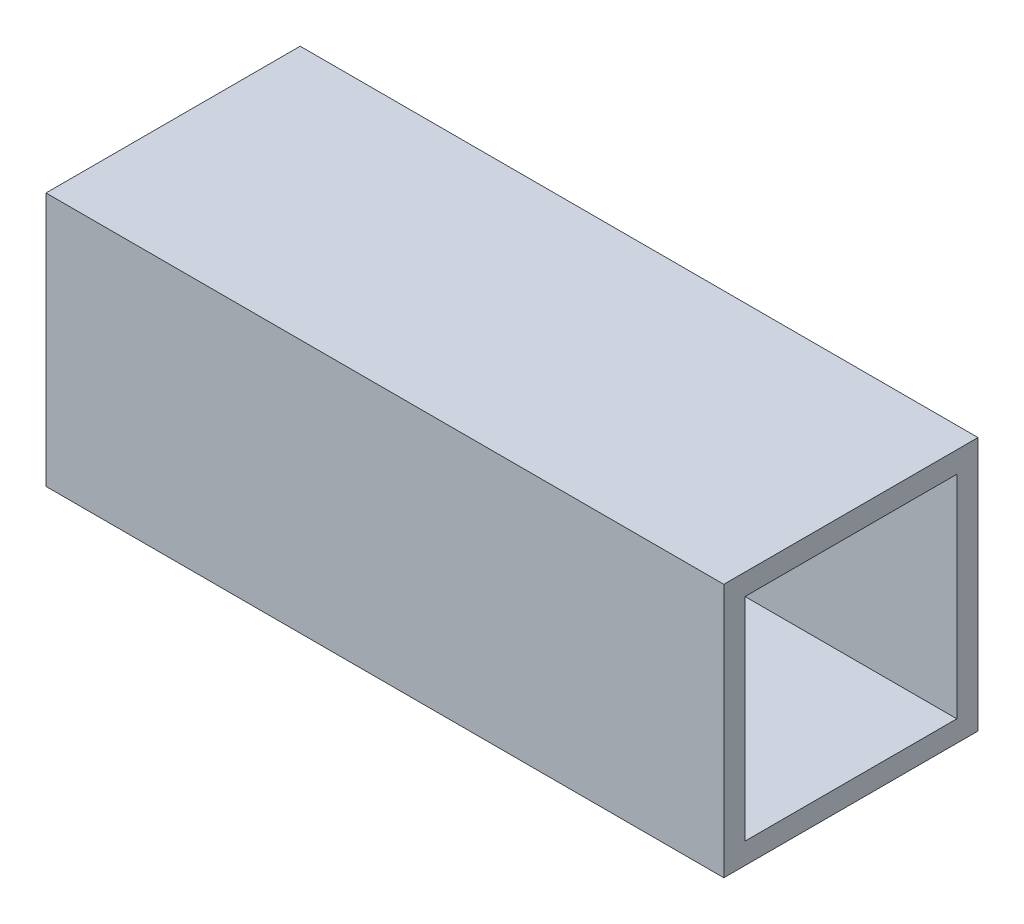
ISO-10303-21;
HEADER;
FILE_DESCRIPTION(('STEP AP214'),'2;1');
FILE_NAME('part.step','',(''),(''),'','','');
FILE_SCHEMA(('AUTOMOTIVE_DESIGN { 1 0 10303 214 1 1 1 1 }'));
ENDSEC;
DATA;
#1=APPLICATION_CONTEXT('core data for automotive mechanical design processes');
#2=APPLICATION_PROTOCOL_DEFINITION('international standard','automotive_design',2000,#1);
#3=PRODUCT_CONTEXT('',#1,'mechanical');
#4=PRODUCT('Part','Part','',(#3));
#5=PRODUCT_RELATED_PRODUCT_CATEGORY('part','',(#4));
#6=PRODUCT_DEFINITION_FORMATION('','',#4);
#7=PRODUCT_DEFINITION_CONTEXT('part definition',#1,'design');
#8=PRODUCT_DEFINITION('design','',#6,#7);
#9=PRODUCT_DEFINITION_SHAPE('','',#8);
#10=(LENGTH_UNIT() NAMED_UNIT(*) SI_UNIT(.MILLI.,.METRE.));
#11=(NAMED_UNIT(*) PLANE_ANGLE_UNIT() SI_UNIT($,.RADIAN.));
#12=(NAMED_UNIT(*) SI_UNIT($,.STERADIAN.) SOLID_ANGLE_UNIT());
#13=UNCERTAINTY_MEASURE_WITH_UNIT(LENGTH_MEASURE(1.E-05),#10,'distance_accuracy_value','');
#14=(GEOMETRIC_REPRESENTATION_CONTEXT(3) GLOBAL_UNCERTAINTY_ASSIGNED_CONTEXT((#13)) GLOBAL_UNIT_ASSIGNED_CONTEXT((#10,
#11,#12)) REPRESENTATION_CONTEXT('',''));
#15=CARTESIAN_POINT('',(0.,0.,0.));
#16=DIRECTION('',(0.,0.,1.));
#17=DIRECTION('',(1.,0.,0.));
#18=AXIS2_PLACEMENT_3D('',#15,#16,#17);
#19=CARTESIAN_POINT('',(-50.8,19.05,-19.05));
#20=DIRECTION('',(0.,1.,0.));
#21=DIRECTION('',(0.,0.,1.));
#22=AXIS2_PLACEMENT_3D('',#19,#20,#21);
#23=PLANE('',#22);
#24=DIRECTION('',(-1.,0.,0.));
#25=VECTOR('',#24,1.);
#26=CARTESIAN_POINT('',(-50.8,19.05,-19.05));
#27=LINE('',#26,#25);
#28=CARTESIAN_POINT('',(-50.8,19.05,-19.05));
#29=VERTEX_POINT('',#28);
#30=CARTESIAN_POINT('',(50.8,19.05,-19.05));
#31=VERTEX_POINT('',#30);
#32=EDGE_CURVE('E114',#29,#31,#27,.F.);
#33=ORIENTED_EDGE('',*,*,#32,.F.);
#34=DIRECTION('',(0.,0.,-1.));
#35=VECTOR('',#34,1.);
#36=CARTESIAN_POINT('',(-50.8,19.05,0.));
#37=LINE('',#36,#35);
#38=CARTESIAN_POINT('',(-50.8,19.05,19.05));
#39=VERTEX_POINT('',#38);
#40=EDGE_CURVE('E136',#29,#39,#37,.F.);
#41=ORIENTED_EDGE('',*,*,#40,.T.);
#42=DIRECTION('',(1.,0.,0.));
#43=VECTOR('',#42,1.);
#44=CARTESIAN_POINT('',(-50.8,19.05,19.05));
#45=LINE('',#44,#43);
#46=CARTESIAN_POINT('',(50.8,19.05,19.05));
#47=VERTEX_POINT('',#46);
#48=EDGE_CURVE('E131',#47,#39,#45,.F.);
#49=ORIENTED_EDGE('',*,*,#48,.F.);
#50=DIRECTION('',(0.,0.,-1.));
#51=VECTOR('',#50,1.);
#52=CARTESIAN_POINT('',(50.8,19.05,0.));
#53=LINE('',#52,#51);
#54=EDGE_CURVE('E106',#31,#47,#53,.F.);
#55=ORIENTED_EDGE('',*,*,#54,.F.);
#56=EDGE_LOOP('',(#33,#41,#49,#55));
#57=FACE_BOUND('',#56,.T.);
#58=ADVANCED_FACE('F17',(#57),#23,.T.);
#59=CARTESIAN_POINT('',(-50.8,15.875,-15.875));
#60=DIRECTION('',(0.,0.,1.));
#61=DIRECTION('',(1.,0.,0.));
#62=AXIS2_PLACEMENT_3D('',#59,#60,#61);
#63=PLANE('',#62);
#64=DIRECTION('',(1.,0.,0.));
#65=VECTOR('',#64,1.);
#66=CARTESIAN_POINT('',(-50.8,15.875,-15.875));
#67=LINE('',#66,#65);
#68=CARTESIAN_POINT('',(-50.8,15.875,-15.875));
#69=VERTEX_POINT('',#68);
#70=CARTESIAN_POINT('',(50.8,15.875,-15.875));
#71=VERTEX_POINT('',#70);
#72=EDGE_CURVE('E91',#69,#71,#67,.T.);
#73=ORIENTED_EDGE('',*,*,#72,.F.);
#74=DIRECTION('',(0.,1.,0.));
#75=VECTOR('',#74,1.);
#76=CARTESIAN_POINT('',(-50.8,0.,-15.875));
#77=LINE('',#76,#75);
#78=CARTESIAN_POINT('',(-50.8,-15.875,-15.875));
#79=VERTEX_POINT('',#78);
#80=EDGE_CURVE('E139',#69,#79,#77,.F.);
#81=ORIENTED_EDGE('',*,*,#80,.T.);
#82=DIRECTION('',(1.,0.,0.));
#83=VECTOR('',#82,1.);
#84=CARTESIAN_POINT('',(-50.8,-15.875,-15.875));
#85=LINE('',#84,#83);
#86=CARTESIAN_POINT('',(50.8,-15.875,-15.875));
#87=VERTEX_POINT('',#86);
#88=EDGE_CURVE('E20',#87,#79,#85,.F.);
#89=ORIENTED_EDGE('',*,*,#88,.F.);
#90=DIRECTION('',(0.,1.,0.));
#91=VECTOR('',#90,1.);
#92=CARTESIAN_POINT('',(50.8,0.,-15.875));
#93=LINE('',#92,#91);
#94=EDGE_CURVE('E105',#71,#87,#93,.F.);
#95=ORIENTED_EDGE('',*,*,#94,.F.);
#96=EDGE_LOOP('',(#73,#81,#89,#95));
#97=FACE_BOUND('',#96,.T.);
#98=ADVANCED_FACE('F125',(#97),#63,.T.);
#99=CARTESIAN_POINT('',(-50.8,-15.875,-15.875));
#100=DIRECTION('',(0.,1.,0.));
#101=DIRECTION('',(0.,0.,1.));
#102=AXIS2_PLACEMENT_3D('',#99,#100,#101);
#103=PLANE('',#102);
#104=ORIENTED_EDGE('',*,*,#88,.T.);
#105=DIRECTION('',(0.,0.,-1.));
#106=VECTOR('',#105,1.);
#107=CARTESIAN_POINT('',(-50.8,-15.875,0.));
#108=LINE('',#107,#106);
#109=CARTESIAN_POINT('',(-50.8,-15.875,15.875));
#110=VERTEX_POINT('',#109);
#111=EDGE_CURVE('E88',#79,#110,#108,.F.);
#112=ORIENTED_EDGE('',*,*,#111,.T.);
#113=DIRECTION('',(-1.,0.,0.));
#114=VECTOR('',#113,1.);
#115=CARTESIAN_POINT('',(-50.8,-15.875,15.875));
#116=LINE('',#115,#114);
#117=CARTESIAN_POINT('',(50.8,-15.875,15.875));
#118=VERTEX_POINT('',#117);
#119=EDGE_CURVE('E80',#118,#110,#116,.T.);
#120=ORIENTED_EDGE('',*,*,#119,.F.);
#121=DIRECTION('',(0.,0.,-1.));
#122=VECTOR('',#121,1.);
#123=CARTESIAN_POINT('',(50.8,-15.875,0.));
#124=LINE('',#123,#122);
#125=EDGE_CURVE('E85',#87,#118,#124,.F.);
#126=ORIENTED_EDGE('',*,*,#125,.F.);
#127=EDGE_LOOP('',(#104,#112,#120,#126));
#128=FACE_BOUND('',#127,.T.);
#129=ADVANCED_FACE('F83',(#128),#103,.T.);
#130=CARTESIAN_POINT('',(-50.8,-15.875,15.875));
#131=DIRECTION('',(0.,0.,-1.));
#132=DIRECTION('',(-1.,0.,0.));
#133=AXIS2_PLACEMENT_3D('',#130,#131,#132);
#134=PLANE('',#133);
#135=ORIENTED_EDGE('',*,*,#119,.T.);
#136=DIRECTION('',(0.,1.,0.));
#137=VECTOR('',#136,1.);
#138=CARTESIAN_POINT('',(-50.8,0.,15.875));
#139=LINE('',#138,#137);
#140=CARTESIAN_POINT('',(-50.8,15.875,15.875));
#141=VERTEX_POINT('',#140);
#142=EDGE_CURVE('E142',#110,#141,#139,.T.);
#143=ORIENTED_EDGE('',*,*,#142,.T.);
#144=DIRECTION('',(1.,0.,0.));
#145=VECTOR('',#144,1.);
#146=CARTESIAN_POINT('',(-50.8,15.875,15.875));
#147=LINE('',#146,#145);
#148=CARTESIAN_POINT('',(50.8,15.875,15.875));
#149=VERTEX_POINT('',#148);
#150=EDGE_CURVE('E96',#149,#141,#147,.F.);
#151=ORIENTED_EDGE('',*,*,#150,.F.);
#152=DIRECTION('',(0.,1.,0.));
#153=VECTOR('',#152,1.);
#154=CARTESIAN_POINT('',(50.8,0.,15.875));
#155=LINE('',#154,#153);
#156=EDGE_CURVE('E93',#118,#149,#155,.T.);
#157=ORIENTED_EDGE('',*,*,#156,.F.);
#158=EDGE_LOOP('',(#135,#143,#151,#157));
#159=FACE_BOUND('',#158,.T.);
#160=ADVANCED_FACE('F94',(#159),#134,.T.);
#161=CARTESIAN_POINT('',(-50.8,15.875,15.875));
#162=DIRECTION('',(0.,-1.,0.));
#163=DIRECTION('',(0.,0.,-1.));
#164=AXIS2_PLACEMENT_3D('',#161,#162,#163);
#165=PLANE('',#164);
#166=ORIENTED_EDGE('',*,*,#150,.T.);
#167=DIRECTION('',(0.,0.,-1.));
#168=VECTOR('',#167,1.);
#169=CARTESIAN_POINT('',(-50.8,15.875,0.));
#170=LINE('',#169,#168);
#171=EDGE_CURVE('E122',#141,#69,#170,.T.);
#172=ORIENTED_EDGE('',*,*,#171,.T.);
#173=ORIENTED_EDGE('',*,*,#72,.T.);
#174=DIRECTION('',(0.,0.,-1.));
#175=VECTOR('',#174,1.);
#176=CARTESIAN_POINT('',(50.8,15.875,0.));
#177=LINE('',#176,#175);
#178=EDGE_CURVE('E100',#149,#71,#177,.T.);
#179=ORIENTED_EDGE('',*,*,#178,.F.);
#180=EDGE_LOOP('',(#166,#172,#173,#179));
#181=FACE_BOUND('',#180,.T.);
#182=ADVANCED_FACE('F120',(#181),#165,.T.);
#183=CARTESIAN_POINT('',(-50.8,-19.05,-19.05));
#184=DIRECTION('',(0.,0.,-1.));
#185=DIRECTION('',(-1.,0.,0.));
#186=AXIS2_PLACEMENT_3D('',#183,#184,#185);
#187=PLANE('',#186);
#188=DIRECTION('',(1.,0.,0.));
#189=VECTOR('',#188,1.);
#190=CARTESIAN_POINT('',(-50.8,-19.05,-19.05));
#191=LINE('',#190,#189);
#192=CARTESIAN_POINT('',(-50.8,-19.05,-19.05));
#193=VERTEX_POINT('',#192);
#194=CARTESIAN_POINT('',(50.8,-19.05,-19.05));
#195=VERTEX_POINT('',#194);
#196=EDGE_CURVE('E145',#193,#195,#191,.T.);
#197=ORIENTED_EDGE('',*,*,#196,.F.);
#198=DIRECTION('',(0.,1.,0.));
#199=VECTOR('',#198,1.);
#200=CARTESIAN_POINT('',(-50.8,0.,-19.05));
#201=LINE('',#200,#199);
#202=EDGE_CURVE('E133',#193,#29,#201,.T.);
#203=ORIENTED_EDGE('',*,*,#202,.T.);
#204=ORIENTED_EDGE('',*,*,#32,.T.);
#205=DIRECTION('',(0.,1.,0.));
#206=VECTOR('',#205,1.);
#207=CARTESIAN_POINT('',(50.8,0.,-19.05));
#208=LINE('',#207,#206);
#209=EDGE_CURVE('E108',#195,#31,#208,.T.);
#210=ORIENTED_EDGE('',*,*,#209,.F.);
#211=EDGE_LOOP('',(#197,#203,#204,#210));
#212=FACE_BOUND('',#211,.T.);
#213=ADVANCED_FACE('F164',(#212),#187,.T.);
#214=CARTESIAN_POINT('',(50.8,0.,0.));
#215=DIRECTION('',(1.,0.,0.));
#216=DIRECTION('',(0.,0.,-1.));
#217=AXIS2_PLACEMENT_3D('',#214,#215,#216);
#218=PLANE('',#217);
#219=ORIENTED_EDGE('',*,*,#178,.T.);
#220=ORIENTED_EDGE('',*,*,#94,.T.);
#221=ORIENTED_EDGE('',*,*,#125,.T.);
#222=ORIENTED_EDGE('',*,*,#156,.T.);
#223=EDGE_LOOP('',(#219,#220,#221,#222));
#224=FACE_BOUND('',#223,.T.);
#225=DIRECTION('',(0.,1.,0.));
#226=VECTOR('',#225,1.);
#227=CARTESIAN_POINT('',(50.8,19.05,19.05));
#228=LINE('',#227,#226);
#229=CARTESIAN_POINT('',(50.8,-19.05,19.05));
#230=VERTEX_POINT('',#229);
#231=EDGE_CURVE('E126',#230,#47,#228,.T.);
#232=ORIENTED_EDGE('',*,*,#231,.F.);
#233=DIRECTION('',(0.,0.,-1.));
#234=VECTOR('',#233,1.);
#235=CARTESIAN_POINT('',(50.8,-19.05,19.05));
#236=LINE('',#235,#234);
#237=EDGE_CURVE('E148',#195,#230,#236,.F.);
#238=ORIENTED_EDGE('',*,*,#237,.F.);
#239=ORIENTED_EDGE('',*,*,#209,.T.);
#240=ORIENTED_EDGE('',*,*,#54,.T.);
#241=EDGE_LOOP('',(#232,#238,#239,#240));
#242=FACE_BOUND('',#241,.T.);
#243=ADVANCED_FACE('F102',(#224,#242),#218,.T.);
#244=CARTESIAN_POINT('',(-50.8,19.05,19.05));
#245=DIRECTION('',(0.,0.,1.));
#246=DIRECTION('',(1.,0.,0.));
#247=AXIS2_PLACEMENT_3D('',#244,#245,#246);
#248=PLANE('',#247);
#249=ORIENTED_EDGE('',*,*,#48,.T.);
#250=DIRECTION('',(0.,1.,0.));
#251=VECTOR('',#250,1.);
#252=CARTESIAN_POINT('',(-50.8,0.,19.05));
#253=LINE('',#252,#251);
#254=CARTESIAN_POINT('',(-50.8,-19.05,19.05));
#255=VERTEX_POINT('',#254);
#256=EDGE_CURVE('E35',#39,#255,#253,.F.);
#257=ORIENTED_EDGE('',*,*,#256,.T.);
#258=DIRECTION('',(1.,0.,0.));
#259=VECTOR('',#258,1.);
#260=CARTESIAN_POINT('',(-50.8,-19.05,19.05));
#261=LINE('',#260,#259);
#262=EDGE_CURVE('E26',#230,#255,#261,.F.);
#263=ORIENTED_EDGE('',*,*,#262,.F.);
#264=ORIENTED_EDGE('',*,*,#231,.T.);
#265=EDGE_LOOP('',(#249,#257,#263,#264));
#266=FACE_BOUND('',#265,.T.);
#267=ADVANCED_FACE('F155',(#266),#248,.T.);
#268=CARTESIAN_POINT('',(-50.8,0.,0.));
#269=DIRECTION('',(1.,0.,0.));
#270=DIRECTION('',(0.,0.,-1.));
#271=AXIS2_PLACEMENT_3D('',#268,#269,#270);
#272=PLANE('',#271);
#273=ORIENTED_EDGE('',*,*,#142,.F.);
#274=ORIENTED_EDGE('',*,*,#111,.F.);
#275=ORIENTED_EDGE('',*,*,#80,.F.);
#276=ORIENTED_EDGE('',*,*,#171,.F.);
#277=EDGE_LOOP('',(#273,#274,#275,#276));
#278=FACE_BOUND('',#277,.T.);
#279=ORIENTED_EDGE('',*,*,#40,.F.);
#280=ORIENTED_EDGE('',*,*,#202,.F.);
#281=DIRECTION('',(0.,0.,-1.));
#282=VECTOR('',#281,1.);
#283=CARTESIAN_POINT('',(-50.8,-19.05,19.05));
#284=LINE('',#283,#282);
#285=EDGE_CURVE('E11',#255,#193,#284,.T.);
#286=ORIENTED_EDGE('',*,*,#285,.F.);
#287=ORIENTED_EDGE('',*,*,#256,.F.);
#288=EDGE_LOOP('',(#279,#280,#286,#287));
#289=FACE_BOUND('',#288,.T.);
#290=ADVANCED_FACE('F162',(#278,#289),#272,.F.);
#291=CARTESIAN_POINT('',(-50.8,-19.05,19.05));
#292=DIRECTION('',(0.,-1.,0.));
#293=DIRECTION('',(0.,0.,-1.));
#294=AXIS2_PLACEMENT_3D('',#291,#292,#293);
#295=PLANE('',#294);
#296=ORIENTED_EDGE('',*,*,#262,.T.);
#297=ORIENTED_EDGE('',*,*,#285,.T.);
#298=ORIENTED_EDGE('',*,*,#196,.T.);
#299=ORIENTED_EDGE('',*,*,#237,.T.);
#300=EDGE_LOOP('',(#296,#297,#298,#299));
#301=FACE_BOUND('',#300,.T.);
#302=ADVANCED_FACE('F153',(#301),#295,.T.);
#303=CLOSED_SHELL('',(#58,#98,#129,#160,#182,#213,#243,#267,#290,#302));
#304=MANIFOLD_SOLID_BREP('B1',#303);
#305=ADVANCED_BREP_SHAPE_REPRESENTATION('',(#18,#304),#14);
#306=SHAPE_DEFINITION_REPRESENTATION(#9,#305);
ENDSEC;
END-ISO-10303-21;
